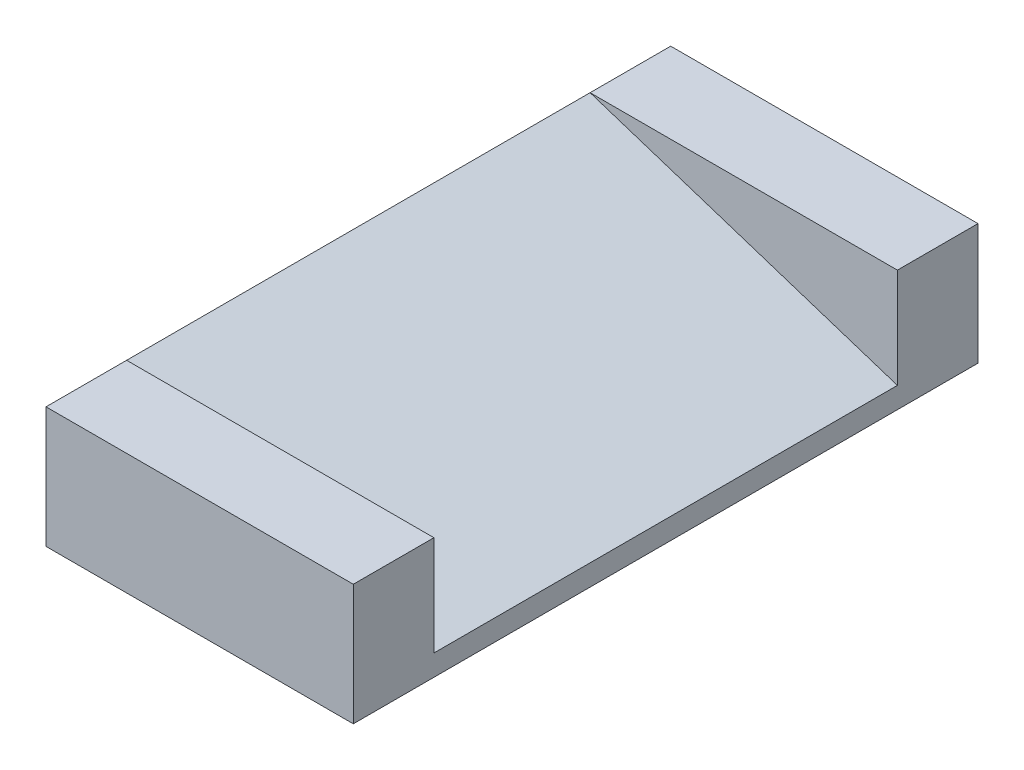
ISO-10303-21;
HEADER;
FILE_DESCRIPTION(('STEP AP214'),'2;1');
FILE_NAME('part.step','',(''),(''),'','','');
FILE_SCHEMA(('AUTOMOTIVE_DESIGN { 1 0 10303 214 1 1 1 1 }'));
ENDSEC;
DATA;
#1=APPLICATION_CONTEXT('core data for automotive mechanical design processes');
#2=APPLICATION_PROTOCOL_DEFINITION('international standard','automotive_design',2000,#1);
#3=PRODUCT_CONTEXT('',#1,'mechanical');
#4=PRODUCT('Part','Part','',(#3));
#5=PRODUCT_RELATED_PRODUCT_CATEGORY('part','',(#4));
#6=PRODUCT_DEFINITION_FORMATION('','',#4);
#7=PRODUCT_DEFINITION_CONTEXT('part definition',#1,'design');
#8=PRODUCT_DEFINITION('design','',#6,#7);
#9=PRODUCT_DEFINITION_SHAPE('','',#8);
#10=(LENGTH_UNIT() NAMED_UNIT(*) SI_UNIT(.MILLI.,.METRE.));
#11=(NAMED_UNIT(*) PLANE_ANGLE_UNIT() SI_UNIT($,.RADIAN.));
#12=(NAMED_UNIT(*) SI_UNIT($,.STERADIAN.) SOLID_ANGLE_UNIT());
#13=UNCERTAINTY_MEASURE_WITH_UNIT(LENGTH_MEASURE(1.E-05),#10,'distance_accuracy_value','');
#14=(GEOMETRIC_REPRESENTATION_CONTEXT(3) GLOBAL_UNCERTAINTY_ASSIGNED_CONTEXT((#13)) GLOBAL_UNIT_ASSIGNED_CONTEXT((#10,
#11,#12)) REPRESENTATION_CONTEXT('',''));
#15=CARTESIAN_POINT('',(0.,0.,0.));
#16=DIRECTION('',(0.,0.,1.));
#17=DIRECTION('',(1.,0.,0.));
#18=AXIS2_PLACEMENT_3D('',#15,#16,#17);
#19=CARTESIAN_POINT('',(0.,12.,0.));
#20=DIRECTION('',(0.,1.,0.));
#21=DIRECTION('',(0.,0.,1.));
#22=AXIS2_PLACEMENT_3D('',#19,#20,#21);
#23=PLANE('',#22);
#24=DIRECTION('',(0.,0.,1.));
#25=VECTOR('',#24,1.);
#26=CARTESIAN_POINT('',(-15.25,12.,-31.));
#27=LINE('',#26,#25);
#28=CARTESIAN_POINT('',(-15.25,12.,-31.));
#29=VERTEX_POINT('',#28);
#30=CARTESIAN_POINT('',(-15.25,12.,-23.));
#31=VERTEX_POINT('',#30);
#32=EDGE_CURVE('E139',#29,#31,#27,.T.);
#33=ORIENTED_EDGE('',*,*,#32,.T.);
#34=DIRECTION('',(1.,0.,0.));
#35=VECTOR('',#34,1.);
#36=CARTESIAN_POINT('',(15.25,12.,-23.));
#37=LINE('',#36,#35);
#38=CARTESIAN_POINT('',(15.25,12.,-23.));
#39=VERTEX_POINT('',#38);
#40=EDGE_CURVE('E57',#31,#39,#37,.T.);
#41=ORIENTED_EDGE('',*,*,#40,.T.);
#42=DIRECTION('',(0.,0.,-1.));
#43=VECTOR('',#42,1.);
#44=CARTESIAN_POINT('',(15.25,12.,-31.));
#45=LINE('',#44,#43);
#46=CARTESIAN_POINT('',(15.25,12.,-31.));
#47=VERTEX_POINT('',#46);
#48=EDGE_CURVE('E151',#39,#47,#45,.T.);
#49=ORIENTED_EDGE('',*,*,#48,.T.);
#50=DIRECTION('',(-1.,0.,0.));
#51=VECTOR('',#50,1.);
#52=CARTESIAN_POINT('',(-15.25,12.,-31.));
#53=LINE('',#52,#51);
#54=EDGE_CURVE('E66',#47,#29,#53,.T.);
#55=ORIENTED_EDGE('',*,*,#54,.T.);
#56=EDGE_LOOP('',(#33,#41,#49,#55));
#57=FACE_BOUND('',#56,.T.);
#58=ADVANCED_FACE('F41',(#57),#23,.T.);
#59=CARTESIAN_POINT('',(-15.25,12.,-31.));
#60=DIRECTION('',(1.,0.,0.));
#61=DIRECTION('',(0.,0.,-1.));
#62=AXIS2_PLACEMENT_3D('',#59,#60,#61);
#63=PLANE('',#62);
#64=DIRECTION('',(0.,0.,1.));
#65=VECTOR('',#64,1.);
#66=CARTESIAN_POINT('',(-15.25,0.,-31.));
#67=LINE('',#66,#65);
#68=CARTESIAN_POINT('',(-15.25,0.,-31.));
#69=VERTEX_POINT('',#68);
#70=CARTESIAN_POINT('',(-15.25,0.,31.));
#71=VERTEX_POINT('',#70);
#72=EDGE_CURVE('E157',#69,#71,#67,.T.);
#73=ORIENTED_EDGE('',*,*,#72,.T.);
#74=DIRECTION('',(0.,-1.,0.));
#75=VECTOR('',#74,1.);
#76=CARTESIAN_POINT('',(-15.25,12.,31.));
#77=LINE('',#76,#75);
#78=CARTESIAN_POINT('',(-15.25,12.,31.));
#79=VERTEX_POINT('',#78);
#80=EDGE_CURVE('E11',#79,#71,#77,.T.);
#81=ORIENTED_EDGE('',*,*,#80,.F.);
#82=CARTESIAN_POINT('',(-15.25,12.,23.));
#83=VERTEX_POINT('',#82);
#84=EDGE_CURVE('E95',#83,#79,#27,.T.);
#85=ORIENTED_EDGE('',*,*,#84,.F.);
#86=DIRECTION('',(0.,0.,-1.));
#87=VECTOR('',#86,1.);
#88=CARTESIAN_POINT('',(-15.25,12.,55.0695978392671));
#89=LINE('',#88,#87);
#90=EDGE_CURVE('E112',#83,#31,#89,.T.);
#91=ORIENTED_EDGE('',*,*,#90,.T.);
#92=ORIENTED_EDGE('',*,*,#32,.F.);
#93=DIRECTION('',(0.,-1.,0.));
#94=VECTOR('',#93,1.);
#95=CARTESIAN_POINT('',(-15.25,12.,-31.));
#96=LINE('',#95,#94);
#97=EDGE_CURVE('E156',#29,#69,#96,.T.);
#98=ORIENTED_EDGE('',*,*,#97,.T.);
#99=EDGE_LOOP('',(#73,#81,#85,#91,#92,#98));
#100=FACE_BOUND('',#99,.T.);
#101=ADVANCED_FACE('F43',(#100),#63,.F.);
#102=CARTESIAN_POINT('',(-15.25,12.,31.));
#103=DIRECTION('',(0.,0.,-1.));
#104=DIRECTION('',(-1.,0.,0.));
#105=AXIS2_PLACEMENT_3D('',#102,#103,#104);
#106=PLANE('',#105);
#107=DIRECTION('',(1.,0.,0.));
#108=VECTOR('',#107,1.);
#109=CARTESIAN_POINT('',(-15.25,0.,31.));
#110=LINE('',#109,#108);
#111=CARTESIAN_POINT('',(15.25,0.,31.));
#112=VERTEX_POINT('',#111);
#113=EDGE_CURVE('E160',#71,#112,#110,.T.);
#114=ORIENTED_EDGE('',*,*,#113,.T.);
#115=DIRECTION('',(0.,-1.,0.));
#116=VECTOR('',#115,1.);
#117=CARTESIAN_POINT('',(15.25,12.,31.));
#118=LINE('',#117,#116);
#119=CARTESIAN_POINT('',(15.25,12.,31.));
#120=VERTEX_POINT('',#119);
#121=EDGE_CURVE('E50',#120,#112,#118,.T.);
#122=ORIENTED_EDGE('',*,*,#121,.F.);
#123=DIRECTION('',(1.,0.,0.));
#124=VECTOR('',#123,1.);
#125=CARTESIAN_POINT('',(-15.25,12.,31.));
#126=LINE('',#125,#124);
#127=EDGE_CURVE('E143',#79,#120,#126,.T.);
#128=ORIENTED_EDGE('',*,*,#127,.F.);
#129=ORIENTED_EDGE('',*,*,#80,.T.);
#130=EDGE_LOOP('',(#114,#122,#128,#129));
#131=FACE_BOUND('',#130,.T.);
#132=ADVANCED_FACE('F208',(#131),#106,.F.);
#133=CARTESIAN_POINT('',(15.25,12.,-31.));
#134=DIRECTION('',(-1.,0.,0.));
#135=DIRECTION('',(0.,0.,1.));
#136=AXIS2_PLACEMENT_3D('',#133,#134,#135);
#137=PLANE('',#136);
#138=DIRECTION('',(0.,0.,-1.));
#139=VECTOR('',#138,1.);
#140=CARTESIAN_POINT('',(15.25,2.08994926489657,55.0695978392671));
#141=LINE('',#140,#139);
#142=CARTESIAN_POINT('',(15.25,2.08994926489656,23.));
#143=VERTEX_POINT('',#142);
#144=CARTESIAN_POINT('',(15.25,2.08994926489657,-23.));
#145=VERTEX_POINT('',#144);
#146=EDGE_CURVE('E148',#143,#145,#141,.T.);
#147=ORIENTED_EDGE('',*,*,#146,.F.);
#148=DIRECTION('',(0.,-1.,0.));
#149=VECTOR('',#148,1.);
#150=CARTESIAN_POINT('',(15.25,2.08994926489657,23.));
#151=LINE('',#150,#149);
#152=CARTESIAN_POINT('',(15.25,12.,23.));
#153=VERTEX_POINT('',#152);
#154=EDGE_CURVE('E126',#153,#143,#151,.T.);
#155=ORIENTED_EDGE('',*,*,#154,.F.);
#156=EDGE_CURVE('E133',#120,#153,#45,.T.);
#157=ORIENTED_EDGE('',*,*,#156,.F.);
#158=ORIENTED_EDGE('',*,*,#121,.T.);
#159=DIRECTION('',(0.,0.,-1.));
#160=VECTOR('',#159,1.);
#161=CARTESIAN_POINT('',(15.25,0.,-31.));
#162=LINE('',#161,#160);
#163=CARTESIAN_POINT('',(15.25,0.,-31.));
#164=VERTEX_POINT('',#163);
#165=EDGE_CURVE('E144',#112,#164,#162,.T.);
#166=ORIENTED_EDGE('',*,*,#165,.T.);
#167=DIRECTION('',(0.,-1.,0.));
#168=VECTOR('',#167,1.);
#169=CARTESIAN_POINT('',(15.25,12.,-31.));
#170=LINE('',#169,#168);
#171=EDGE_CURVE('E167',#47,#164,#170,.T.);
#172=ORIENTED_EDGE('',*,*,#171,.F.);
#173=ORIENTED_EDGE('',*,*,#48,.F.);
#174=DIRECTION('',(0.,-1.,0.));
#175=VECTOR('',#174,1.);
#176=CARTESIAN_POINT('',(15.25,2.08994926489657,-23.));
#177=LINE('',#176,#175);
#178=EDGE_CURVE('E183',#39,#145,#177,.T.);
#179=ORIENTED_EDGE('',*,*,#178,.T.);
#180=EDGE_LOOP('',(#147,#155,#157,#158,#166,#172,#173,#179));
#181=FACE_BOUND('',#180,.T.);
#182=ADVANCED_FACE('F174',(#181),#137,.F.);
#183=CARTESIAN_POINT('',(-15.25,12.,-31.));
#184=DIRECTION('',(0.,0.,1.));
#185=DIRECTION('',(1.,0.,0.));
#186=AXIS2_PLACEMENT_3D('',#183,#184,#185);
#187=PLANE('',#186);
#188=DIRECTION('',(-1.,0.,0.));
#189=VECTOR('',#188,1.);
#190=CARTESIAN_POINT('',(-15.25,0.,-31.));
#191=LINE('',#190,#189);
#192=EDGE_CURVE('E87',#164,#69,#191,.T.);
#193=ORIENTED_EDGE('',*,*,#192,.T.);
#194=ORIENTED_EDGE('',*,*,#97,.F.);
#195=ORIENTED_EDGE('',*,*,#54,.F.);
#196=ORIENTED_EDGE('',*,*,#171,.T.);
#197=EDGE_LOOP('',(#193,#194,#195,#196));
#198=FACE_BOUND('',#197,.T.);
#199=ADVANCED_FACE('F180',(#198),#187,.F.);
#200=DIRECTION('',(1.,0.,0.));
#201=VECTOR('',#200,1.);
#202=CARTESIAN_POINT('',(15.25,12.,23.));
#203=LINE('',#202,#201);
#204=EDGE_CURVE('E121',#83,#153,#203,.T.);
#205=ORIENTED_EDGE('',*,*,#204,.F.);
#206=ORIENTED_EDGE('',*,*,#84,.T.);
#207=ORIENTED_EDGE('',*,*,#127,.T.);
#208=ORIENTED_EDGE('',*,*,#156,.T.);
#209=EDGE_LOOP('',(#205,#206,#207,#208));
#210=FACE_BOUND('',#209,.T.);
#211=ADVANCED_FACE('F131',(#210),#23,.T.);
#212=CARTESIAN_POINT('',(0.,0.,0.));
#213=DIRECTION('',(0.,1.,0.));
#214=DIRECTION('',(0.,0.,1.));
#215=AXIS2_PLACEMENT_3D('',#212,#213,#214);
#216=PLANE('',#215);
#217=ORIENTED_EDGE('',*,*,#72,.F.);
#218=ORIENTED_EDGE('',*,*,#192,.F.);
#219=ORIENTED_EDGE('',*,*,#165,.F.);
#220=ORIENTED_EDGE('',*,*,#113,.F.);
#221=EDGE_LOOP('',(#217,#218,#219,#220));
#222=FACE_BOUND('',#221,.T.);
#223=ADVANCED_FACE('F179',(#222),#216,.F.);
#224=CARTESIAN_POINT('',(0.,0.,23.));
#225=DIRECTION('',(0.,0.,1.));
#226=DIRECTION('',(1.,0.,0.));
#227=AXIS2_PLACEMENT_3D('',#224,#225,#226);
#228=PLANE('',#227);
#229=ORIENTED_EDGE('',*,*,#154,.T.);
#230=DIRECTION('',(-0.951056516295156,0.309016994374942,0.));
#231=VECTOR('',#230,1.);
#232=CARTESIAN_POINT('',(-15.25,12.,23.));
#233=LINE('',#232,#231);
#234=EDGE_CURVE('E115',#143,#83,#233,.T.);
#235=ORIENTED_EDGE('',*,*,#234,.T.);
#236=ORIENTED_EDGE('',*,*,#204,.T.);
#237=EDGE_LOOP('',(#229,#235,#236));
#238=FACE_BOUND('',#237,.T.);
#239=ADVANCED_FACE('F124',(#238),#228,.F.);
#240=CARTESIAN_POINT('',(0.,0.,-23.));
#241=DIRECTION('',(0.,0.,1.));
#242=DIRECTION('',(1.,0.,0.));
#243=AXIS2_PLACEMENT_3D('',#240,#241,#242);
#244=PLANE('',#243);
#245=ORIENTED_EDGE('',*,*,#178,.F.);
#246=ORIENTED_EDGE('',*,*,#40,.F.);
#247=DIRECTION('',(-0.951056516295156,0.309016994374942,0.));
#248=VECTOR('',#247,1.);
#249=CARTESIAN_POINT('',(-15.25,12.,-23.));
#250=LINE('',#249,#248);
#251=EDGE_CURVE('E117',#145,#31,#250,.T.);
#252=ORIENTED_EDGE('',*,*,#251,.F.);
#253=EDGE_LOOP('',(#245,#246,#252));
#254=FACE_BOUND('',#253,.T.);
#255=ADVANCED_FACE('F194',(#254),#244,.T.);
#256=CARTESIAN_POINT('',(-15.25,12.,55.0695978392671));
#257=DIRECTION('',(-0.309016994374942,-0.951056516295156,0.));
#258=DIRECTION('',(0.951056516295156,-0.309016994374942,0.));
#259=AXIS2_PLACEMENT_3D('',#256,#257,#258);
#260=PLANE('',#259);
#261=ORIENTED_EDGE('',*,*,#146,.T.);
#262=ORIENTED_EDGE('',*,*,#251,.T.);
#263=ORIENTED_EDGE('',*,*,#90,.F.);
#264=ORIENTED_EDGE('',*,*,#234,.F.);
#265=EDGE_LOOP('',(#261,#262,#263,#264));
#266=FACE_BOUND('',#265,.T.);
#267=ADVANCED_FACE('F114',(#266),#260,.F.);
#268=CLOSED_SHELL('',(#58,#101,#132,#182,#199,#211,#223,#239,#255,#267));
#269=MANIFOLD_SOLID_BREP('B2',#268);
#270=ADVANCED_BREP_SHAPE_REPRESENTATION('',(#18,#269),#14);
#271=SHAPE_DEFINITION_REPRESENTATION(#9,#270);
ENDSEC;
END-ISO-10303-21;
